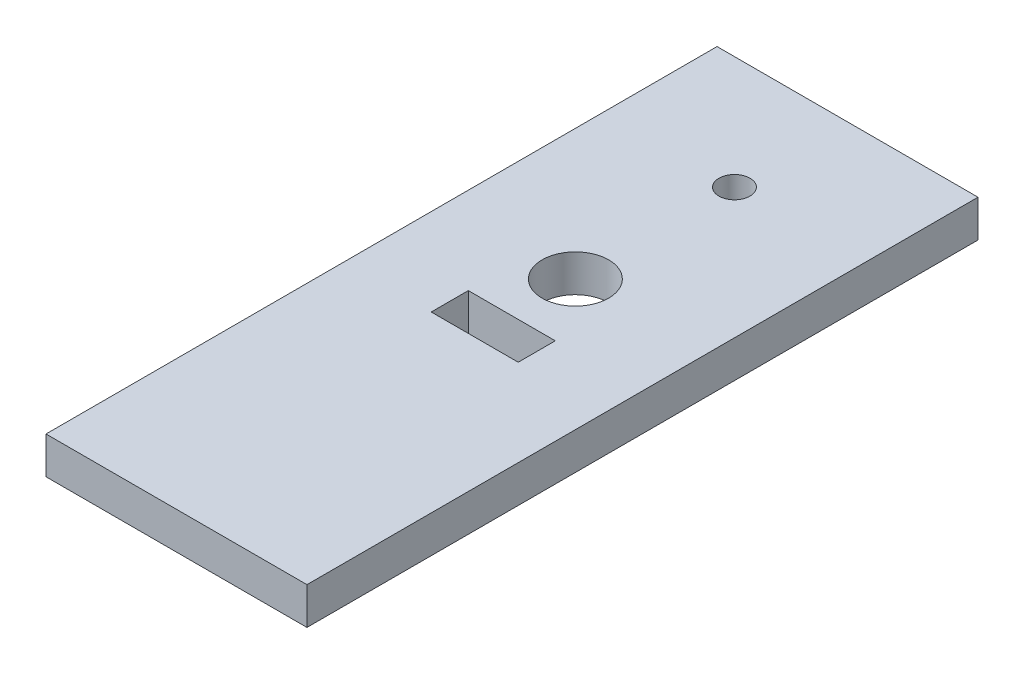
ISO-10303-21;
HEADER;
FILE_DESCRIPTION(('STEP AP214'),'2;1');
FILE_NAME('part.step','',(''),(''),'','','');
FILE_SCHEMA(('AUTOMOTIVE_DESIGN { 1 0 10303 214 1 1 1 1 }'));
ENDSEC;
DATA;
#1=APPLICATION_CONTEXT('core data for automotive mechanical design processes');
#2=APPLICATION_PROTOCOL_DEFINITION('international standard','automotive_design',2000,#1);
#3=PRODUCT_CONTEXT('',#1,'mechanical');
#4=PRODUCT('Part','Part','',(#3));
#5=PRODUCT_RELATED_PRODUCT_CATEGORY('part','',(#4));
#6=PRODUCT_DEFINITION_FORMATION('','',#4);
#7=PRODUCT_DEFINITION_CONTEXT('part definition',#1,'design');
#8=PRODUCT_DEFINITION('design','',#6,#7);
#9=PRODUCT_DEFINITION_SHAPE('','',#8);
#10=(LENGTH_UNIT() NAMED_UNIT(*) SI_UNIT(.MILLI.,.METRE.));
#11=(NAMED_UNIT(*) PLANE_ANGLE_UNIT() SI_UNIT($,.RADIAN.));
#12=(NAMED_UNIT(*) SI_UNIT($,.STERADIAN.) SOLID_ANGLE_UNIT());
#13=UNCERTAINTY_MEASURE_WITH_UNIT(LENGTH_MEASURE(1.E-05),#10,'distance_accuracy_value','');
#14=(GEOMETRIC_REPRESENTATION_CONTEXT(3) GLOBAL_UNCERTAINTY_ASSIGNED_CONTEXT((#13)) GLOBAL_UNIT_ASSIGNED_CONTEXT((#10,
#11,#12)) REPRESENTATION_CONTEXT('',''));
#15=CARTESIAN_POINT('',(0.,0.,0.));
#16=DIRECTION('',(0.,0.,1.));
#17=DIRECTION('',(1.,0.,0.));
#18=AXIS2_PLACEMENT_3D('',#15,#16,#17);
#19=CARTESIAN_POINT('',(0.,5.969,0.));
#20=DIRECTION('',(0.,-1.,0.));
#21=DIRECTION('',(0.,0.,-1.));
#22=AXIS2_PLACEMENT_3D('',#19,#20,#21);
#23=PLANE('',#22);
#24=DIRECTION('',(-1.,0.,0.));
#25=VECTOR('',#24,1.);
#26=CARTESIAN_POINT('',(0.,5.969,0.));
#27=LINE('',#26,#25);
#28=CARTESIAN_POINT('',(28.,5.969,0.));
#29=VERTEX_POINT('',#28);
#30=CARTESIAN_POINT('',(14.,5.969,0.));
#31=VERTEX_POINT('',#30);
#32=EDGE_CURVE('E126',#29,#31,#27,.T.);
#33=ORIENTED_EDGE('',*,*,#32,.T.);
#34=DIRECTION('',(0.,0.,-1.));
#35=VECTOR('',#34,1.);
#36=CARTESIAN_POINT('',(14.,5.969,0.));
#37=LINE('',#36,#35);
#38=CARTESIAN_POINT('',(14.,5.969,-5.969));
#39=VERTEX_POINT('',#38);
#40=EDGE_CURVE('E84',#31,#39,#37,.T.);
#41=ORIENTED_EDGE('',*,*,#40,.T.);
#42=DIRECTION('',(1.,0.,0.));
#43=VECTOR('',#42,1.);
#44=CARTESIAN_POINT('',(14.,5.969,-5.969));
#45=LINE('',#44,#43);
#46=CARTESIAN_POINT('',(28.,5.969,-5.969));
#47=VERTEX_POINT('',#46);
#48=EDGE_CURVE('E150',#39,#47,#45,.T.);
#49=ORIENTED_EDGE('',*,*,#48,.T.);
#50=DIRECTION('',(0.,0.,1.));
#51=VECTOR('',#50,1.);
#52=CARTESIAN_POINT('',(28.,5.969,-5.969));
#53=LINE('',#52,#51);
#54=EDGE_CURVE('E152',#47,#29,#53,.T.);
#55=ORIENTED_EDGE('',*,*,#54,.T.);
#56=EDGE_LOOP('',(#33,#41,#49,#55));
#57=FACE_BOUND('',#56,.T.);
#58=DIRECTION('',(0.,0.,1.));
#59=VECTOR('',#58,1.);
#60=CARTESIAN_POINT('',(0.,5.969,0.));
#61=LINE('',#60,#59);
#62=CARTESIAN_POINT('',(0.,5.969,-60.));
#63=VERTEX_POINT('',#62);
#64=CARTESIAN_POINT('',(0.,5.969,48.));
#65=VERTEX_POINT('',#64);
#66=EDGE_CURVE('E147',#63,#65,#61,.T.);
#67=ORIENTED_EDGE('',*,*,#66,.T.);
#68=DIRECTION('',(1.,0.,0.));
#69=VECTOR('',#68,1.);
#70=CARTESIAN_POINT('',(0.,5.969,48.));
#71=LINE('',#70,#69);
#72=CARTESIAN_POINT('',(42.,5.969,48.));
#73=VERTEX_POINT('',#72);
#74=EDGE_CURVE('E128',#65,#73,#71,.T.);
#75=ORIENTED_EDGE('',*,*,#74,.T.);
#76=DIRECTION('',(0.,0.,-1.));
#77=VECTOR('',#76,1.);
#78=CARTESIAN_POINT('',(42.,5.969,0.));
#79=LINE('',#78,#77);
#80=CARTESIAN_POINT('',(42.,5.969,-60.));
#81=VERTEX_POINT('',#80);
#82=EDGE_CURVE('E117',#73,#81,#79,.T.);
#83=ORIENTED_EDGE('',*,*,#82,.T.);
#84=DIRECTION('',(-1.,0.,0.));
#85=VECTOR('',#84,1.);
#86=CARTESIAN_POINT('',(0.,5.969,-60.));
#87=LINE('',#86,#85);
#88=EDGE_CURVE('E49',#81,#63,#87,.T.);
#89=ORIENTED_EDGE('',*,*,#88,.T.);
#90=EDGE_LOOP('',(#67,#75,#83,#89));
#91=FACE_BOUND('',#90,.T.);
#92=CARTESIAN_POINT('',(21.,5.969,-16.2));
#93=DIRECTION('',(0.,1.,0.));
#94=DIRECTION('',(0.,0.,1.));
#95=AXIS2_PLACEMENT_3D('',#92,#93,#94);
#96=CIRCLE('',#95,5.35);
#97=CARTESIAN_POINT('',(21.,5.969,-10.85));
#98=VERTEX_POINT('',#97);
#99=EDGE_CURVE('E141',#98,#98,#96,.T.);
#100=ORIENTED_EDGE('',*,*,#99,.F.);
#101=EDGE_LOOP('',(#100));
#102=FACE_BOUND('',#101,.T.);
#103=CARTESIAN_POINT('',(21.,5.969,-41.8));
#104=DIRECTION('',(0.,1.,0.));
#105=DIRECTION('',(0.,0.,1.));
#106=AXIS2_PLACEMENT_3D('',#103,#104,#105);
#107=CIRCLE('',#106,2.5);
#108=CARTESIAN_POINT('',(21.,5.969,-39.3));
#109=VERTEX_POINT('',#108);
#110=EDGE_CURVE('E135',#109,#109,#107,.T.);
#111=ORIENTED_EDGE('',*,*,#110,.F.);
#112=EDGE_LOOP('',(#111));
#113=FACE_BOUND('',#112,.T.);
#114=ADVANCED_FACE('F32',(#57,#91,#102,#113),#23,.F.);
#115=CARTESIAN_POINT('',(0.,0.,0.));
#116=DIRECTION('',(0.,-1.,0.));
#117=DIRECTION('',(0.,0.,-1.));
#118=AXIS2_PLACEMENT_3D('',#115,#116,#117);
#119=PLANE('',#118);
#120=DIRECTION('',(0.,0.,-1.));
#121=VECTOR('',#120,1.);
#122=CARTESIAN_POINT('',(14.,0.,0.));
#123=LINE('',#122,#121);
#124=CARTESIAN_POINT('',(14.,0.,0.));
#125=VERTEX_POINT('',#124);
#126=CARTESIAN_POINT('',(14.,0.,-5.969));
#127=VERTEX_POINT('',#126);
#128=EDGE_CURVE('E159',#125,#127,#123,.T.);
#129=ORIENTED_EDGE('',*,*,#128,.F.);
#130=DIRECTION('',(-1.,0.,0.));
#131=VECTOR('',#130,1.);
#132=CARTESIAN_POINT('',(0.,0.,0.));
#133=LINE('',#132,#131);
#134=CARTESIAN_POINT('',(28.,0.,0.));
#135=VERTEX_POINT('',#134);
#136=EDGE_CURVE('E121',#135,#125,#133,.T.);
#137=ORIENTED_EDGE('',*,*,#136,.F.);
#138=DIRECTION('',(0.,0.,1.));
#139=VECTOR('',#138,1.);
#140=CARTESIAN_POINT('',(28.,0.,-5.969));
#141=LINE('',#140,#139);
#142=CARTESIAN_POINT('',(28.,0.,-5.969));
#143=VERTEX_POINT('',#142);
#144=EDGE_CURVE('E112',#143,#135,#141,.T.);
#145=ORIENTED_EDGE('',*,*,#144,.F.);
#146=DIRECTION('',(1.,0.,0.));
#147=VECTOR('',#146,1.);
#148=CARTESIAN_POINT('',(14.,0.,-5.969));
#149=LINE('',#148,#147);
#150=EDGE_CURVE('E161',#127,#143,#149,.T.);
#151=ORIENTED_EDGE('',*,*,#150,.F.);
#152=EDGE_LOOP('',(#129,#137,#145,#151));
#153=FACE_BOUND('',#152,.T.);
#154=CARTESIAN_POINT('',(21.,0.,-16.2));
#155=DIRECTION('',(0.,1.,0.));
#156=DIRECTION('',(0.,0.,1.));
#157=AXIS2_PLACEMENT_3D('',#154,#155,#156);
#158=CIRCLE('',#157,5.35);
#159=CARTESIAN_POINT('',(21.,0.,-10.85));
#160=VERTEX_POINT('',#159);
#161=EDGE_CURVE('E138',#160,#160,#158,.T.);
#162=ORIENTED_EDGE('',*,*,#161,.T.);
#163=EDGE_LOOP('',(#162));
#164=FACE_BOUND('',#163,.T.);
#165=DIRECTION('',(0.,0.,1.));
#166=VECTOR('',#165,1.);
#167=CARTESIAN_POINT('',(0.,0.,0.));
#168=LINE('',#167,#166);
#169=CARTESIAN_POINT('',(0.,0.,-60.));
#170=VERTEX_POINT('',#169);
#171=CARTESIAN_POINT('',(0.,0.,48.));
#172=VERTEX_POINT('',#171);
#173=EDGE_CURVE('E144',#170,#172,#168,.T.);
#174=ORIENTED_EDGE('',*,*,#173,.F.);
#175=DIRECTION('',(-1.,0.,0.));
#176=VECTOR('',#175,1.);
#177=CARTESIAN_POINT('',(0.,0.,-60.));
#178=LINE('',#177,#176);
#179=CARTESIAN_POINT('',(42.,0.,-60.));
#180=VERTEX_POINT('',#179);
#181=EDGE_CURVE('E76',#180,#170,#178,.T.);
#182=ORIENTED_EDGE('',*,*,#181,.F.);
#183=DIRECTION('',(0.,0.,-1.));
#184=VECTOR('',#183,1.);
#185=CARTESIAN_POINT('',(42.,0.,0.));
#186=LINE('',#185,#184);
#187=CARTESIAN_POINT('',(42.,0.,48.));
#188=VERTEX_POINT('',#187);
#189=EDGE_CURVE('E70',#188,#180,#186,.T.);
#190=ORIENTED_EDGE('',*,*,#189,.F.);
#191=DIRECTION('',(1.,0.,0.));
#192=VECTOR('',#191,1.);
#193=CARTESIAN_POINT('',(0.,0.,48.));
#194=LINE('',#193,#192);
#195=EDGE_CURVE('E110',#172,#188,#194,.T.);
#196=ORIENTED_EDGE('',*,*,#195,.F.);
#197=EDGE_LOOP('',(#174,#182,#190,#196));
#198=FACE_BOUND('',#197,.T.);
#199=CARTESIAN_POINT('',(21.,0.,-41.8));
#200=DIRECTION('',(0.,1.,0.));
#201=DIRECTION('',(0.,0.,1.));
#202=AXIS2_PLACEMENT_3D('',#199,#200,#201);
#203=CIRCLE('',#202,2.5);
#204=CARTESIAN_POINT('',(21.,0.,-39.3));
#205=VERTEX_POINT('',#204);
#206=EDGE_CURVE('E134',#205,#205,#203,.T.);
#207=ORIENTED_EDGE('',*,*,#206,.T.);
#208=EDGE_LOOP('',(#207));
#209=FACE_BOUND('',#208,.T.);
#210=ADVANCED_FACE('F107',(#153,#164,#198,#209),#119,.T.);
#211=CARTESIAN_POINT('',(0.,5.969,0.));
#212=DIRECTION('',(1.,0.,0.));
#213=DIRECTION('',(0.,0.,-1.));
#214=AXIS2_PLACEMENT_3D('',#211,#212,#213);
#215=PLANE('',#214);
#216=ORIENTED_EDGE('',*,*,#173,.T.);
#217=DIRECTION('',(0.,1.,0.));
#218=VECTOR('',#217,1.);
#219=CARTESIAN_POINT('',(0.,-63.7808748764079,48.));
#220=LINE('',#219,#218);
#221=EDGE_CURVE('E125',#172,#65,#220,.T.);
#222=ORIENTED_EDGE('',*,*,#221,.T.);
#223=ORIENTED_EDGE('',*,*,#66,.F.);
#224=DIRECTION('',(0.,-1.,0.));
#225=VECTOR('',#224,1.);
#226=CARTESIAN_POINT('',(0.,5.969,-60.));
#227=LINE('',#226,#225);
#228=EDGE_CURVE('E157',#63,#170,#227,.T.);
#229=ORIENTED_EDGE('',*,*,#228,.T.);
#230=EDGE_LOOP('',(#216,#222,#223,#229));
#231=FACE_BOUND('',#230,.T.);
#232=ADVANCED_FACE('F34',(#231),#215,.F.);
#233=CARTESIAN_POINT('',(14.,5.969,0.));
#234=DIRECTION('',(-1.,0.,0.));
#235=DIRECTION('',(0.,0.,1.));
#236=AXIS2_PLACEMENT_3D('',#233,#234,#235);
#237=PLANE('',#236);
#238=ORIENTED_EDGE('',*,*,#128,.T.);
#239=DIRECTION('',(0.,-1.,0.));
#240=VECTOR('',#239,1.);
#241=CARTESIAN_POINT('',(14.,5.969,-5.969));
#242=LINE('',#241,#240);
#243=EDGE_CURVE('E41',#39,#127,#242,.T.);
#244=ORIENTED_EDGE('',*,*,#243,.F.);
#245=ORIENTED_EDGE('',*,*,#40,.F.);
#246=DIRECTION('',(0.,-1.,0.));
#247=VECTOR('',#246,1.);
#248=CARTESIAN_POINT('',(14.,5.969,0.));
#249=LINE('',#248,#247);
#250=EDGE_CURVE('E11',#31,#125,#249,.T.);
#251=ORIENTED_EDGE('',*,*,#250,.T.);
#252=EDGE_LOOP('',(#238,#244,#245,#251));
#253=FACE_BOUND('',#252,.T.);
#254=ADVANCED_FACE('F190',(#253),#237,.F.);
#255=CARTESIAN_POINT('',(14.,5.969,-5.969));
#256=DIRECTION('',(0.,0.,-1.));
#257=DIRECTION('',(-1.,0.,0.));
#258=AXIS2_PLACEMENT_3D('',#255,#256,#257);
#259=PLANE('',#258);
#260=ORIENTED_EDGE('',*,*,#150,.T.);
#261=DIRECTION('',(0.,-1.,0.));
#262=VECTOR('',#261,1.);
#263=CARTESIAN_POINT('',(28.,5.969,-5.969));
#264=LINE('',#263,#262);
#265=EDGE_CURVE('E171',#47,#143,#264,.T.);
#266=ORIENTED_EDGE('',*,*,#265,.F.);
#267=ORIENTED_EDGE('',*,*,#48,.F.);
#268=ORIENTED_EDGE('',*,*,#243,.T.);
#269=EDGE_LOOP('',(#260,#266,#267,#268));
#270=FACE_BOUND('',#269,.T.);
#271=ADVANCED_FACE('F177',(#270),#259,.F.);
#272=CARTESIAN_POINT('',(28.,5.969,-5.969));
#273=DIRECTION('',(1.,0.,0.));
#274=DIRECTION('',(0.,0.,-1.));
#275=AXIS2_PLACEMENT_3D('',#272,#273,#274);
#276=PLANE('',#275);
#277=ORIENTED_EDGE('',*,*,#144,.T.);
#278=DIRECTION('',(0.,-1.,0.));
#279=VECTOR('',#278,1.);
#280=CARTESIAN_POINT('',(28.,5.969,0.));
#281=LINE('',#280,#279);
#282=EDGE_CURVE('E169',#29,#135,#281,.T.);
#283=ORIENTED_EDGE('',*,*,#282,.F.);
#284=ORIENTED_EDGE('',*,*,#54,.F.);
#285=ORIENTED_EDGE('',*,*,#265,.T.);
#286=EDGE_LOOP('',(#277,#283,#284,#285));
#287=FACE_BOUND('',#286,.T.);
#288=ADVANCED_FACE('F187',(#287),#276,.F.);
#289=CARTESIAN_POINT('',(42.,5.969,0.));
#290=DIRECTION('',(-1.,0.,0.));
#291=DIRECTION('',(0.,0.,1.));
#292=AXIS2_PLACEMENT_3D('',#289,#290,#291);
#293=PLANE('',#292);
#294=ORIENTED_EDGE('',*,*,#189,.T.);
#295=DIRECTION('',(0.,-1.,0.));
#296=VECTOR('',#295,1.);
#297=CARTESIAN_POINT('',(42.,5.969,-60.));
#298=LINE('',#297,#296);
#299=EDGE_CURVE('E167',#81,#180,#298,.T.);
#300=ORIENTED_EDGE('',*,*,#299,.F.);
#301=ORIENTED_EDGE('',*,*,#82,.F.);
#302=DIRECTION('',(0.,1.,0.));
#303=VECTOR('',#302,1.);
#304=CARTESIAN_POINT('',(42.,-63.7808748764079,48.));
#305=LINE('',#304,#303);
#306=EDGE_CURVE('E115',#188,#73,#305,.T.);
#307=ORIENTED_EDGE('',*,*,#306,.F.);
#308=EDGE_LOOP('',(#294,#300,#301,#307));
#309=FACE_BOUND('',#308,.T.);
#310=ADVANCED_FACE('F116',(#309),#293,.F.);
#311=CARTESIAN_POINT('',(0.,5.969,-60.));
#312=DIRECTION('',(0.,0.,1.));
#313=DIRECTION('',(1.,0.,0.));
#314=AXIS2_PLACEMENT_3D('',#311,#312,#313);
#315=PLANE('',#314);
#316=ORIENTED_EDGE('',*,*,#181,.T.);
#317=ORIENTED_EDGE('',*,*,#228,.F.);
#318=ORIENTED_EDGE('',*,*,#88,.F.);
#319=ORIENTED_EDGE('',*,*,#299,.T.);
#320=EDGE_LOOP('',(#316,#317,#318,#319));
#321=FACE_BOUND('',#320,.T.);
#322=ADVANCED_FACE('F211',(#321),#315,.F.);
#323=CARTESIAN_POINT('',(21.,5.969,-16.2));
#324=DIRECTION('',(0.,-1.,0.));
#325=DIRECTION('',(0.,0.,-1.));
#326=AXIS2_PLACEMENT_3D('',#323,#324,#325);
#327=CYLINDRICAL_SURFACE('',#326,5.35);
#328=ORIENTED_EDGE('',*,*,#99,.T.);
#329=EDGE_LOOP('',(#328));
#330=FACE_BOUND('',#329,.T.);
#331=ORIENTED_EDGE('',*,*,#161,.F.);
#332=EDGE_LOOP('',(#331));
#333=FACE_BOUND('',#332,.T.);
#334=ADVANCED_FACE('F200',(#330,#333),#327,.F.);
#335=CARTESIAN_POINT('',(21.,5.969,-41.8));
#336=DIRECTION('',(0.,-1.,0.));
#337=DIRECTION('',(0.,0.,-1.));
#338=AXIS2_PLACEMENT_3D('',#335,#336,#337);
#339=CYLINDRICAL_SURFACE('',#338,2.5);
#340=ORIENTED_EDGE('',*,*,#110,.T.);
#341=EDGE_LOOP('',(#340));
#342=FACE_BOUND('',#341,.T.);
#343=ORIENTED_EDGE('',*,*,#206,.F.);
#344=EDGE_LOOP('',(#343));
#345=FACE_BOUND('',#344,.T.);
#346=ADVANCED_FACE('F193',(#342,#345),#339,.F.);
#347=CARTESIAN_POINT('',(0.,-63.7808748764079,0.));
#348=DIRECTION('',(0.,0.,-1.));
#349=DIRECTION('',(-1.,0.,0.));
#350=AXIS2_PLACEMENT_3D('',#347,#348,#349);
#351=PLANE('',#350);
#352=ORIENTED_EDGE('',*,*,#250,.F.);
#353=ORIENTED_EDGE('',*,*,#32,.F.);
#354=ORIENTED_EDGE('',*,*,#282,.T.);
#355=ORIENTED_EDGE('',*,*,#136,.T.);
#356=EDGE_LOOP('',(#352,#353,#354,#355));
#357=FACE_BOUND('',#356,.T.);
#358=ADVANCED_FACE('F191',(#357),#351,.T.);
#359=CARTESIAN_POINT('',(0.,-63.7808748764079,48.));
#360=DIRECTION('',(0.,0.,1.));
#361=DIRECTION('',(1.,0.,0.));
#362=AXIS2_PLACEMENT_3D('',#359,#360,#361);
#363=PLANE('',#362);
#364=ORIENTED_EDGE('',*,*,#221,.F.);
#365=ORIENTED_EDGE('',*,*,#195,.T.);
#366=ORIENTED_EDGE('',*,*,#306,.T.);
#367=ORIENTED_EDGE('',*,*,#74,.F.);
#368=EDGE_LOOP('',(#364,#365,#366,#367));
#369=FACE_BOUND('',#368,.T.);
#370=ADVANCED_FACE('F123',(#369),#363,.T.);
#371=CLOSED_SHELL('',(#114,#210,#232,#254,#271,#288,#310,#322,#334,#346,#358,#370));
#372=MANIFOLD_SOLID_BREP('B2',#371);
#373=ADVANCED_BREP_SHAPE_REPRESENTATION('',(#18,#372),#14);
#374=SHAPE_DEFINITION_REPRESENTATION(#9,#373);
ENDSEC;
END-ISO-10303-21;
